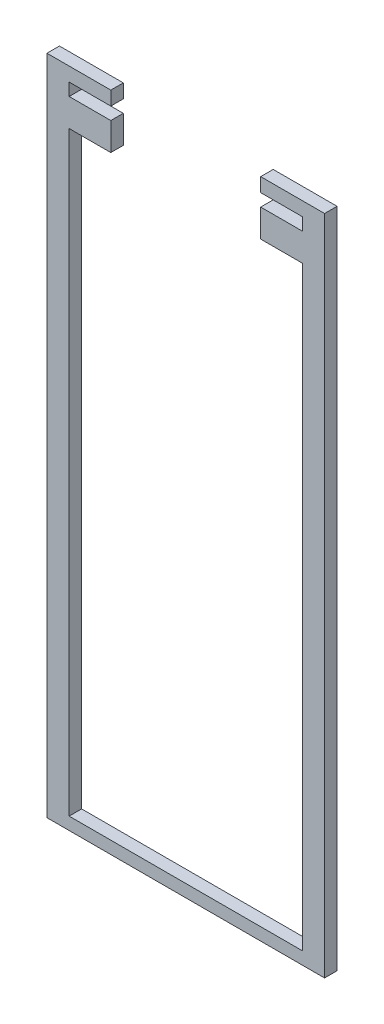
ISO-10303-21;
HEADER;
FILE_DESCRIPTION(('STEP AP214'),'2;1');
FILE_NAME('part.step','',(''),(''),'','','');
FILE_SCHEMA(('AUTOMOTIVE_DESIGN { 1 0 10303 214 1 1 1 1 }'));
ENDSEC;
DATA;
#1=APPLICATION_CONTEXT('core data for automotive mechanical design processes');
#2=APPLICATION_PROTOCOL_DEFINITION('international standard','automotive_design',2000,#1);
#3=PRODUCT_CONTEXT('',#1,'mechanical');
#4=PRODUCT('Part','Part','',(#3));
#5=PRODUCT_RELATED_PRODUCT_CATEGORY('part','',(#4));
#6=PRODUCT_DEFINITION_FORMATION('','',#4);
#7=PRODUCT_DEFINITION_CONTEXT('part definition',#1,'design');
#8=PRODUCT_DEFINITION('design','',#6,#7);
#9=PRODUCT_DEFINITION_SHAPE('','',#8);
#10=(LENGTH_UNIT() NAMED_UNIT(*) SI_UNIT(.MILLI.,.METRE.));
#11=(NAMED_UNIT(*) PLANE_ANGLE_UNIT() SI_UNIT($,.RADIAN.));
#12=(NAMED_UNIT(*) SI_UNIT($,.STERADIAN.) SOLID_ANGLE_UNIT());
#13=UNCERTAINTY_MEASURE_WITH_UNIT(LENGTH_MEASURE(1.E-05),#10,'distance_accuracy_value','');
#14=(GEOMETRIC_REPRESENTATION_CONTEXT(3) GLOBAL_UNCERTAINTY_ASSIGNED_CONTEXT((#13)) GLOBAL_UNIT_ASSIGNED_CONTEXT((#10,
#11,#12)) REPRESENTATION_CONTEXT('',''));
#15=CARTESIAN_POINT('',(0.,0.,0.));
#16=DIRECTION('',(0.,0.,1.));
#17=DIRECTION('',(1.,0.,0.));
#18=AXIS2_PLACEMENT_3D('',#15,#16,#17);
#19=CARTESIAN_POINT('',(40.120933274522,117.892622477071,4.5));
#20=DIRECTION('',(0.,-1.,0.));
#21=DIRECTION('',(0.,0.,-1.));
#22=AXIS2_PLACEMENT_3D('',#19,#20,#21);
#23=PLANE('',#22);
#24=DIRECTION('',(-1.,0.,0.));
#25=VECTOR('',#24,1.);
#26=CARTESIAN_POINT('',(40.120933274522,117.892622477071,0.));
#27=LINE('',#26,#25);
#28=CARTESIAN_POINT('',(40.120933274522,117.892622477071,0.));
#29=VERTEX_POINT('',#28);
#30=CARTESIAN_POINT('',(25.1209332745221,117.892622477071,0.));
#31=VERTEX_POINT('',#30);
#32=EDGE_CURVE('E207',#29,#31,#27,.T.);
#33=ORIENTED_EDGE('',*,*,#32,.T.);
#34=DIRECTION('',(0.,0.,-1.));
#35=VECTOR('',#34,1.);
#36=CARTESIAN_POINT('',(25.1209332745221,117.892622477071,4.5));
#37=LINE('',#36,#35);
#38=CARTESIAN_POINT('',(25.1209332745221,117.892622477071,4.5));
#39=VERTEX_POINT('',#38);
#40=EDGE_CURVE('E11',#39,#31,#37,.T.);
#41=ORIENTED_EDGE('',*,*,#40,.F.);
#42=DIRECTION('',(-1.,0.,0.));
#43=VECTOR('',#42,1.);
#44=CARTESIAN_POINT('',(40.120933274522,117.892622477071,4.5));
#45=LINE('',#44,#43);
#46=CARTESIAN_POINT('',(40.120933274522,117.892622477071,4.5));
#47=VERTEX_POINT('',#46);
#48=EDGE_CURVE('E245',#47,#39,#45,.T.);
#49=ORIENTED_EDGE('',*,*,#48,.F.);
#50=DIRECTION('',(0.,0.,-1.));
#51=VECTOR('',#50,1.);
#52=CARTESIAN_POINT('',(40.120933274522,117.892622477071,4.5));
#53=LINE('',#52,#51);
#54=EDGE_CURVE('E203',#47,#29,#53,.T.);
#55=ORIENTED_EDGE('',*,*,#54,.T.);
#56=EDGE_LOOP('',(#33,#41,#49,#55));
#57=FACE_BOUND('',#56,.T.);
#58=ADVANCED_FACE('F39',(#57),#23,.F.);
#59=CARTESIAN_POINT('',(25.1209332745221,117.892622477071,4.5));
#60=DIRECTION('',(1.,0.,0.));
#61=DIRECTION('',(0.,0.,-1.));
#62=AXIS2_PLACEMENT_3D('',#59,#60,#61);
#63=PLANE('',#62);
#64=DIRECTION('',(0.,-1.,0.));
#65=VECTOR('',#64,1.);
#66=CARTESIAN_POINT('',(25.1209332745221,117.892622477071,0.));
#67=LINE('',#66,#65);
#68=CARTESIAN_POINT('',(25.1209332745221,107.892622477071,0.));
#69=VERTEX_POINT('',#68);
#70=EDGE_CURVE('E210',#31,#69,#67,.T.);
#71=ORIENTED_EDGE('',*,*,#70,.T.);
#72=DIRECTION('',(0.,0.,-1.));
#73=VECTOR('',#72,1.);
#74=CARTESIAN_POINT('',(25.1209332745221,107.892622477071,4.5));
#75=LINE('',#74,#73);
#76=CARTESIAN_POINT('',(25.1209332745221,107.892622477071,4.5));
#77=VERTEX_POINT('',#76);
#78=EDGE_CURVE('E47',#77,#69,#75,.T.);
#79=ORIENTED_EDGE('',*,*,#78,.F.);
#80=DIRECTION('',(0.,-1.,0.));
#81=VECTOR('',#80,1.);
#82=CARTESIAN_POINT('',(25.1209332745221,117.892622477071,4.5));
#83=LINE('',#82,#81);
#84=EDGE_CURVE('E134',#39,#77,#83,.T.);
#85=ORIENTED_EDGE('',*,*,#84,.F.);
#86=ORIENTED_EDGE('',*,*,#40,.T.);
#87=EDGE_LOOP('',(#71,#79,#85,#86));
#88=FACE_BOUND('',#87,.T.);
#89=ADVANCED_FACE('F363',(#88),#63,.F.);
#90=CARTESIAN_POINT('',(25.1209332745221,107.892622477071,4.5));
#91=DIRECTION('',(0.,1.,0.));
#92=DIRECTION('',(0.,0.,1.));
#93=AXIS2_PLACEMENT_3D('',#90,#91,#92);
#94=PLANE('',#93);
#95=DIRECTION('',(1.,0.,0.));
#96=VECTOR('',#95,1.);
#97=CARTESIAN_POINT('',(25.1209332745221,107.892622477071,0.));
#98=LINE('',#97,#96);
#99=CARTESIAN_POINT('',(40.120933274522,107.892622477071,0.));
#100=VERTEX_POINT('',#99);
#101=EDGE_CURVE('E212',#69,#100,#98,.T.);
#102=ORIENTED_EDGE('',*,*,#101,.T.);
#103=DIRECTION('',(0.,0.,-1.));
#104=VECTOR('',#103,1.);
#105=CARTESIAN_POINT('',(40.120933274522,107.892622477071,4.5));
#106=LINE('',#105,#104);
#107=CARTESIAN_POINT('',(40.120933274522,107.892622477071,4.5));
#108=VERTEX_POINT('',#107);
#109=EDGE_CURVE('E288',#108,#100,#106,.T.);
#110=ORIENTED_EDGE('',*,*,#109,.F.);
#111=DIRECTION('',(1.,0.,0.));
#112=VECTOR('',#111,1.);
#113=CARTESIAN_POINT('',(25.1209332745221,107.892622477071,4.5));
#114=LINE('',#113,#112);
#115=EDGE_CURVE('E296',#77,#108,#114,.T.);
#116=ORIENTED_EDGE('',*,*,#115,.F.);
#117=ORIENTED_EDGE('',*,*,#78,.T.);
#118=EDGE_LOOP('',(#102,#110,#116,#117));
#119=FACE_BOUND('',#118,.T.);
#120=ADVANCED_FACE('F294',(#119),#94,.F.);
#121=CARTESIAN_POINT('',(40.120933274522,107.892622477071,4.5));
#122=DIRECTION('',(1.,0.,0.));
#123=DIRECTION('',(0.,0.,-1.));
#124=AXIS2_PLACEMENT_3D('',#121,#122,#123);
#125=PLANE('',#124);
#126=DIRECTION('',(0.,-1.,0.));
#127=VECTOR('',#126,1.);
#128=CARTESIAN_POINT('',(40.120933274522,107.892622477071,0.));
#129=LINE('',#128,#127);
#130=CARTESIAN_POINT('',(40.120933274522,-106.607377522929,0.));
#131=VERTEX_POINT('',#130);
#132=EDGE_CURVE('E214',#100,#131,#129,.T.);
#133=ORIENTED_EDGE('',*,*,#132,.T.);
#134=DIRECTION('',(0.,0.,-1.));
#135=VECTOR('',#134,1.);
#136=CARTESIAN_POINT('',(40.120933274522,-106.607377522929,4.5));
#137=LINE('',#136,#135);
#138=CARTESIAN_POINT('',(40.120933274522,-106.607377522929,4.5));
#139=VERTEX_POINT('',#138);
#140=EDGE_CURVE('E285',#139,#131,#137,.T.);
#141=ORIENTED_EDGE('',*,*,#140,.F.);
#142=DIRECTION('',(0.,-1.,0.));
#143=VECTOR('',#142,1.);
#144=CARTESIAN_POINT('',(40.120933274522,107.892622477071,4.5));
#145=LINE('',#144,#143);
#146=EDGE_CURVE('E314',#108,#139,#145,.T.);
#147=ORIENTED_EDGE('',*,*,#146,.F.);
#148=ORIENTED_EDGE('',*,*,#109,.T.);
#149=EDGE_LOOP('',(#133,#141,#147,#148));
#150=FACE_BOUND('',#149,.T.);
#151=ADVANCED_FACE('F305',(#150),#125,.F.);
#152=CARTESIAN_POINT('',(40.120933274522,-106.607377522929,4.5));
#153=DIRECTION('',(0.,-1.,0.));
#154=DIRECTION('',(0.,0.,-1.));
#155=AXIS2_PLACEMENT_3D('',#152,#153,#154);
#156=PLANE('',#155);
#157=DIRECTION('',(-1.,0.,0.));
#158=VECTOR('',#157,1.);
#159=CARTESIAN_POINT('',(40.120933274522,-106.607377522929,0.));
#160=LINE('',#159,#158);
#161=CARTESIAN_POINT('',(-43.8790667254779,-106.607377522929,0.));
#162=VERTEX_POINT('',#161);
#163=EDGE_CURVE('E216',#131,#162,#160,.T.);
#164=ORIENTED_EDGE('',*,*,#163,.T.);
#165=DIRECTION('',(0.,0.,-1.));
#166=VECTOR('',#165,1.);
#167=CARTESIAN_POINT('',(-43.8790667254779,-106.607377522929,4.5));
#168=LINE('',#167,#166);
#169=CARTESIAN_POINT('',(-43.8790667254779,-106.607377522929,4.5));
#170=VERTEX_POINT('',#169);
#171=EDGE_CURVE('E282',#170,#162,#168,.T.);
#172=ORIENTED_EDGE('',*,*,#171,.F.);
#173=DIRECTION('',(-1.,0.,0.));
#174=VECTOR('',#173,1.);
#175=CARTESIAN_POINT('',(40.120933274522,-106.607377522929,4.5));
#176=LINE('',#175,#174);
#177=EDGE_CURVE('E311',#139,#170,#176,.T.);
#178=ORIENTED_EDGE('',*,*,#177,.F.);
#179=ORIENTED_EDGE('',*,*,#140,.T.);
#180=EDGE_LOOP('',(#164,#172,#178,#179));
#181=FACE_BOUND('',#180,.T.);
#182=ADVANCED_FACE('F309',(#181),#156,.F.);
#183=CARTESIAN_POINT('',(-43.8790667254779,-106.607377522929,4.5));
#184=DIRECTION('',(-1.,0.,0.));
#185=DIRECTION('',(0.,0.,1.));
#186=AXIS2_PLACEMENT_3D('',#183,#184,#185);
#187=PLANE('',#186);
#188=DIRECTION('',(0.,1.,0.));
#189=VECTOR('',#188,1.);
#190=CARTESIAN_POINT('',(-43.8790667254779,-106.607377522929,0.));
#191=LINE('',#190,#189);
#192=CARTESIAN_POINT('',(-43.8790667254779,107.892622477071,0.));
#193=VERTEX_POINT('',#192);
#194=EDGE_CURVE('E218',#162,#193,#191,.T.);
#195=ORIENTED_EDGE('',*,*,#194,.T.);
#196=DIRECTION('',(0.,0.,-1.));
#197=VECTOR('',#196,1.);
#198=CARTESIAN_POINT('',(-43.8790667254779,107.892622477071,4.5));
#199=LINE('',#198,#197);
#200=CARTESIAN_POINT('',(-43.8790667254779,107.892622477071,4.5));
#201=VERTEX_POINT('',#200);
#202=EDGE_CURVE('E279',#201,#193,#199,.T.);
#203=ORIENTED_EDGE('',*,*,#202,.F.);
#204=DIRECTION('',(0.,1.,0.));
#205=VECTOR('',#204,1.);
#206=CARTESIAN_POINT('',(-43.8790667254779,-106.607377522929,4.5));
#207=LINE('',#206,#205);
#208=EDGE_CURVE('E313',#170,#201,#207,.T.);
#209=ORIENTED_EDGE('',*,*,#208,.F.);
#210=ORIENTED_EDGE('',*,*,#171,.T.);
#211=EDGE_LOOP('',(#195,#203,#209,#210));
#212=FACE_BOUND('',#211,.T.);
#213=ADVANCED_FACE('F376',(#212),#187,.F.);
#214=CARTESIAN_POINT('',(-28.8790667254779,107.892622477071,4.5));
#215=DIRECTION('',(0.,1.,0.));
#216=DIRECTION('',(0.,0.,1.));
#217=AXIS2_PLACEMENT_3D('',#214,#215,#216);
#218=PLANE('',#217);
#219=DIRECTION('',(1.,0.,0.));
#220=VECTOR('',#219,1.);
#221=CARTESIAN_POINT('',(-28.8790667254779,107.892622477071,0.));
#222=LINE('',#221,#220);
#223=CARTESIAN_POINT('',(-28.8790667254779,107.892622477071,0.));
#224=VERTEX_POINT('',#223);
#225=EDGE_CURVE('E220',#193,#224,#222,.T.);
#226=ORIENTED_EDGE('',*,*,#225,.T.);
#227=DIRECTION('',(0.,0.,-1.));
#228=VECTOR('',#227,1.);
#229=CARTESIAN_POINT('',(-28.8790667254779,107.892622477071,4.5));
#230=LINE('',#229,#228);
#231=CARTESIAN_POINT('',(-28.8790667254779,107.892622477071,4.5));
#232=VERTEX_POINT('',#231);
#233=EDGE_CURVE('E276',#232,#224,#230,.T.);
#234=ORIENTED_EDGE('',*,*,#233,.F.);
#235=DIRECTION('',(1.,0.,0.));
#236=VECTOR('',#235,1.);
#237=CARTESIAN_POINT('',(-28.8790667254779,107.892622477071,4.5));
#238=LINE('',#237,#236);
#239=EDGE_CURVE('E316',#201,#232,#238,.T.);
#240=ORIENTED_EDGE('',*,*,#239,.F.);
#241=ORIENTED_EDGE('',*,*,#202,.T.);
#242=EDGE_LOOP('',(#226,#234,#240,#241));
#243=FACE_BOUND('',#242,.T.);
#244=ADVANCED_FACE('F379',(#243),#218,.F.);
#245=CARTESIAN_POINT('',(-28.8790667254779,117.892622477071,4.5));
#246=DIRECTION('',(-1.,0.,0.));
#247=DIRECTION('',(0.,0.,1.));
#248=AXIS2_PLACEMENT_3D('',#245,#246,#247);
#249=PLANE('',#248);
#250=DIRECTION('',(0.,1.,0.));
#251=VECTOR('',#250,1.);
#252=CARTESIAN_POINT('',(-28.8790667254779,117.892622477071,0.));
#253=LINE('',#252,#251);
#254=CARTESIAN_POINT('',(-28.8790667254779,117.892622477071,0.));
#255=VERTEX_POINT('',#254);
#256=EDGE_CURVE('E222',#224,#255,#253,.T.);
#257=ORIENTED_EDGE('',*,*,#256,.T.);
#258=DIRECTION('',(0.,0.,-1.));
#259=VECTOR('',#258,1.);
#260=CARTESIAN_POINT('',(-28.8790667254779,117.892622477071,4.5));
#261=LINE('',#260,#259);
#262=CARTESIAN_POINT('',(-28.8790667254779,117.892622477071,4.5));
#263=VERTEX_POINT('',#262);
#264=EDGE_CURVE('E273',#263,#255,#261,.T.);
#265=ORIENTED_EDGE('',*,*,#264,.F.);
#266=DIRECTION('',(0.,1.,0.));
#267=VECTOR('',#266,1.);
#268=CARTESIAN_POINT('',(-28.8790667254779,117.892622477071,4.5));
#269=LINE('',#268,#267);
#270=EDGE_CURVE('E322',#232,#263,#269,.T.);
#271=ORIENTED_EDGE('',*,*,#270,.F.);
#272=ORIENTED_EDGE('',*,*,#233,.T.);
#273=EDGE_LOOP('',(#257,#265,#271,#272));
#274=FACE_BOUND('',#273,.T.);
#275=ADVANCED_FACE('F383',(#274),#249,.F.);
#276=CARTESIAN_POINT('',(-43.8790667254779,117.892622477071,4.5));
#277=DIRECTION('',(0.,-1.,0.));
#278=DIRECTION('',(0.,0.,-1.));
#279=AXIS2_PLACEMENT_3D('',#276,#277,#278);
#280=PLANE('',#279);
#281=DIRECTION('',(-1.,0.,0.));
#282=VECTOR('',#281,1.);
#283=CARTESIAN_POINT('',(-43.8790667254779,117.892622477071,0.));
#284=LINE('',#283,#282);
#285=CARTESIAN_POINT('',(-43.8790667254779,117.892622477071,0.));
#286=VERTEX_POINT('',#285);
#287=EDGE_CURVE('E224',#255,#286,#284,.T.);
#288=ORIENTED_EDGE('',*,*,#287,.T.);
#289=DIRECTION('',(0.,0.,-1.));
#290=VECTOR('',#289,1.);
#291=CARTESIAN_POINT('',(-43.8790667254779,117.892622477071,4.5));
#292=LINE('',#291,#290);
#293=CARTESIAN_POINT('',(-43.8790667254779,117.892622477071,4.5));
#294=VERTEX_POINT('',#293);
#295=EDGE_CURVE('E270',#294,#286,#292,.T.);
#296=ORIENTED_EDGE('',*,*,#295,.F.);
#297=DIRECTION('',(-1.,0.,0.));
#298=VECTOR('',#297,1.);
#299=CARTESIAN_POINT('',(-43.8790667254779,117.892622477071,4.5));
#300=LINE('',#299,#298);
#301=EDGE_CURVE('E324',#263,#294,#300,.T.);
#302=ORIENTED_EDGE('',*,*,#301,.F.);
#303=ORIENTED_EDGE('',*,*,#264,.T.);
#304=EDGE_LOOP('',(#288,#296,#302,#303));
#305=FACE_BOUND('',#304,.T.);
#306=ADVANCED_FACE('F387',(#305),#280,.F.);
#307=CARTESIAN_POINT('',(-43.8790667254779,117.892622477071,4.5));
#308=DIRECTION('',(-1.,0.,0.));
#309=DIRECTION('',(0.,0.,1.));
#310=AXIS2_PLACEMENT_3D('',#307,#308,#309);
#311=PLANE('',#310);
#312=DIRECTION('',(0.,1.,0.));
#313=VECTOR('',#312,1.);
#314=CARTESIAN_POINT('',(-43.8790667254779,117.892622477071,0.));
#315=LINE('',#314,#313);
#316=CARTESIAN_POINT('',(-43.8790667254779,122.392622477071,0.));
#317=VERTEX_POINT('',#316);
#318=EDGE_CURVE('E226',#286,#317,#315,.T.);
#319=ORIENTED_EDGE('',*,*,#318,.T.);
#320=DIRECTION('',(0.,0.,-1.));
#321=VECTOR('',#320,1.);
#322=CARTESIAN_POINT('',(-43.8790667254779,122.392622477071,4.5));
#323=LINE('',#322,#321);
#324=CARTESIAN_POINT('',(-43.8790667254779,122.392622477071,4.5));
#325=VERTEX_POINT('',#324);
#326=EDGE_CURVE('E267',#325,#317,#323,.T.);
#327=ORIENTED_EDGE('',*,*,#326,.F.);
#328=DIRECTION('',(0.,1.,0.));
#329=VECTOR('',#328,1.);
#330=CARTESIAN_POINT('',(-43.8790667254779,117.892622477071,4.5));
#331=LINE('',#330,#329);
#332=EDGE_CURVE('E326',#294,#325,#331,.T.);
#333=ORIENTED_EDGE('',*,*,#332,.F.);
#334=ORIENTED_EDGE('',*,*,#295,.T.);
#335=EDGE_LOOP('',(#319,#327,#333,#334));
#336=FACE_BOUND('',#335,.T.);
#337=ADVANCED_FACE('F391',(#336),#311,.F.);
#338=CARTESIAN_POINT('',(-43.8790667254779,122.392622477071,4.5));
#339=DIRECTION('',(0.,1.,0.));
#340=DIRECTION('',(0.,0.,1.));
#341=AXIS2_PLACEMENT_3D('',#338,#339,#340);
#342=PLANE('',#341);
#343=DIRECTION('',(1.,0.,0.));
#344=VECTOR('',#343,1.);
#345=CARTESIAN_POINT('',(-43.8790667254779,122.392622477071,0.));
#346=LINE('',#345,#344);
#347=CARTESIAN_POINT('',(-28.8790667254779,122.392622477071,0.));
#348=VERTEX_POINT('',#347);
#349=EDGE_CURVE('E228',#317,#348,#346,.T.);
#350=ORIENTED_EDGE('',*,*,#349,.T.);
#351=DIRECTION('',(0.,0.,-1.));
#352=VECTOR('',#351,1.);
#353=CARTESIAN_POINT('',(-28.8790667254779,122.392622477071,4.5));
#354=LINE('',#353,#352);
#355=CARTESIAN_POINT('',(-28.8790667254779,122.392622477071,4.5));
#356=VERTEX_POINT('',#355);
#357=EDGE_CURVE('E264',#356,#348,#354,.T.);
#358=ORIENTED_EDGE('',*,*,#357,.F.);
#359=DIRECTION('',(1.,0.,0.));
#360=VECTOR('',#359,1.);
#361=CARTESIAN_POINT('',(-43.8790667254779,122.392622477071,4.5));
#362=LINE('',#361,#360);
#363=EDGE_CURVE('E328',#325,#356,#362,.T.);
#364=ORIENTED_EDGE('',*,*,#363,.F.);
#365=ORIENTED_EDGE('',*,*,#326,.T.);
#366=EDGE_LOOP('',(#350,#358,#364,#365));
#367=FACE_BOUND('',#366,.T.);
#368=ADVANCED_FACE('F395',(#367),#342,.F.);
#369=CARTESIAN_POINT('',(-28.8790667254779,122.392622477071,4.5));
#370=DIRECTION('',(-1.,0.,0.));
#371=DIRECTION('',(0.,0.,1.));
#372=AXIS2_PLACEMENT_3D('',#369,#370,#371);
#373=PLANE('',#372);
#374=DIRECTION('',(0.,1.,0.));
#375=VECTOR('',#374,1.);
#376=CARTESIAN_POINT('',(-28.8790667254779,122.392622477071,0.));
#377=LINE('',#376,#375);
#378=CARTESIAN_POINT('',(-28.8790667254779,127.392622477071,0.));
#379=VERTEX_POINT('',#378);
#380=EDGE_CURVE('E230',#348,#379,#377,.T.);
#381=ORIENTED_EDGE('',*,*,#380,.T.);
#382=DIRECTION('',(0.,0.,-1.));
#383=VECTOR('',#382,1.);
#384=CARTESIAN_POINT('',(-28.8790667254779,127.392622477071,4.5));
#385=LINE('',#384,#383);
#386=CARTESIAN_POINT('',(-28.8790667254779,127.392622477071,4.5));
#387=VERTEX_POINT('',#386);
#388=EDGE_CURVE('E261',#387,#379,#385,.T.);
#389=ORIENTED_EDGE('',*,*,#388,.F.);
#390=DIRECTION('',(0.,1.,0.));
#391=VECTOR('',#390,1.);
#392=CARTESIAN_POINT('',(-28.8790667254779,122.392622477071,4.5));
#393=LINE('',#392,#391);
#394=EDGE_CURVE('E330',#356,#387,#393,.T.);
#395=ORIENTED_EDGE('',*,*,#394,.F.);
#396=ORIENTED_EDGE('',*,*,#357,.T.);
#397=EDGE_LOOP('',(#381,#389,#395,#396));
#398=FACE_BOUND('',#397,.T.);
#399=ADVANCED_FACE('F399',(#398),#373,.F.);
#400=CARTESIAN_POINT('',(-28.8790667254779,127.392622477071,4.5));
#401=DIRECTION('',(0.,-1.,0.));
#402=DIRECTION('',(0.,0.,-1.));
#403=AXIS2_PLACEMENT_3D('',#400,#401,#402);
#404=PLANE('',#403);
#405=DIRECTION('',(-1.,0.,0.));
#406=VECTOR('',#405,1.);
#407=CARTESIAN_POINT('',(-28.8790667254779,127.392622477071,0.));
#408=LINE('',#407,#406);
#409=CARTESIAN_POINT('',(-51.879066725478,127.392622477071,0.));
#410=VERTEX_POINT('',#409);
#411=EDGE_CURVE('E232',#379,#410,#408,.T.);
#412=ORIENTED_EDGE('',*,*,#411,.T.);
#413=DIRECTION('',(0.,0.,-1.));
#414=VECTOR('',#413,1.);
#415=CARTESIAN_POINT('',(-51.879066725478,127.392622477071,4.5));
#416=LINE('',#415,#414);
#417=CARTESIAN_POINT('',(-51.879066725478,127.392622477071,4.5));
#418=VERTEX_POINT('',#417);
#419=EDGE_CURVE('E258',#418,#410,#416,.T.);
#420=ORIENTED_EDGE('',*,*,#419,.F.);
#421=DIRECTION('',(-1.,0.,0.));
#422=VECTOR('',#421,1.);
#423=CARTESIAN_POINT('',(-28.8790667254779,127.392622477071,4.5));
#424=LINE('',#423,#422);
#425=EDGE_CURVE('E332',#387,#418,#424,.T.);
#426=ORIENTED_EDGE('',*,*,#425,.F.);
#427=ORIENTED_EDGE('',*,*,#388,.T.);
#428=EDGE_LOOP('',(#412,#420,#426,#427));
#429=FACE_BOUND('',#428,.T.);
#430=ADVANCED_FACE('F403',(#429),#404,.F.);
#431=CARTESIAN_POINT('',(-51.879066725478,127.392622477071,4.5));
#432=DIRECTION('',(1.,0.,0.));
#433=DIRECTION('',(0.,0.,-1.));
#434=AXIS2_PLACEMENT_3D('',#431,#432,#433);
#435=PLANE('',#434);
#436=DIRECTION('',(0.,-1.,0.));
#437=VECTOR('',#436,1.);
#438=CARTESIAN_POINT('',(-51.879066725478,127.392622477071,0.));
#439=LINE('',#438,#437);
#440=CARTESIAN_POINT('',(-51.879066725478,-111.107377522929,0.));
#441=VERTEX_POINT('',#440);
#442=EDGE_CURVE('E234',#410,#441,#439,.T.);
#443=ORIENTED_EDGE('',*,*,#442,.T.);
#444=DIRECTION('',(0.,0.,-1.));
#445=VECTOR('',#444,1.);
#446=CARTESIAN_POINT('',(-51.879066725478,-111.107377522929,4.5));
#447=LINE('',#446,#445);
#448=CARTESIAN_POINT('',(-51.879066725478,-111.107377522929,4.5));
#449=VERTEX_POINT('',#448);
#450=EDGE_CURVE('E255',#449,#441,#447,.T.);
#451=ORIENTED_EDGE('',*,*,#450,.F.);
#452=DIRECTION('',(0.,-1.,0.));
#453=VECTOR('',#452,1.);
#454=CARTESIAN_POINT('',(-51.879066725478,127.392622477071,4.5));
#455=LINE('',#454,#453);
#456=EDGE_CURVE('E334',#418,#449,#455,.T.);
#457=ORIENTED_EDGE('',*,*,#456,.F.);
#458=ORIENTED_EDGE('',*,*,#419,.T.);
#459=EDGE_LOOP('',(#443,#451,#457,#458));
#460=FACE_BOUND('',#459,.T.);
#461=ADVANCED_FACE('F407',(#460),#435,.F.);
#462=CARTESIAN_POINT('',(-51.879066725478,-111.107377522929,4.5));
#463=DIRECTION('',(0.,1.,0.));
#464=DIRECTION('',(0.,0.,1.));
#465=AXIS2_PLACEMENT_3D('',#462,#463,#464);
#466=PLANE('',#465);
#467=DIRECTION('',(1.,0.,0.));
#468=VECTOR('',#467,1.);
#469=CARTESIAN_POINT('',(-51.879066725478,-111.107377522929,0.));
#470=LINE('',#469,#468);
#471=CARTESIAN_POINT('',(48.120933274522,-111.107377522929,0.));
#472=VERTEX_POINT('',#471);
#473=EDGE_CURVE('E236',#441,#472,#470,.T.);
#474=ORIENTED_EDGE('',*,*,#473,.T.);
#475=DIRECTION('',(0.,0.,-1.));
#476=VECTOR('',#475,1.);
#477=CARTESIAN_POINT('',(48.120933274522,-111.107377522929,4.5));
#478=LINE('',#477,#476);
#479=CARTESIAN_POINT('',(48.120933274522,-111.107377522929,4.5));
#480=VERTEX_POINT('',#479);
#481=EDGE_CURVE('E252',#480,#472,#478,.T.);
#482=ORIENTED_EDGE('',*,*,#481,.F.);
#483=DIRECTION('',(1.,0.,0.));
#484=VECTOR('',#483,1.);
#485=CARTESIAN_POINT('',(-51.879066725478,-111.107377522929,4.5));
#486=LINE('',#485,#484);
#487=EDGE_CURVE('E336',#449,#480,#486,.T.);
#488=ORIENTED_EDGE('',*,*,#487,.F.);
#489=ORIENTED_EDGE('',*,*,#450,.T.);
#490=EDGE_LOOP('',(#474,#482,#488,#489));
#491=FACE_BOUND('',#490,.T.);
#492=ADVANCED_FACE('F411',(#491),#466,.F.);
#493=CARTESIAN_POINT('',(48.120933274522,127.392622477071,4.5));
#494=DIRECTION('',(-1.,0.,0.));
#495=DIRECTION('',(0.,0.,1.));
#496=AXIS2_PLACEMENT_3D('',#493,#494,#495);
#497=PLANE('',#496);
#498=DIRECTION('',(0.,1.,0.));
#499=VECTOR('',#498,1.);
#500=CARTESIAN_POINT('',(48.120933274522,127.392622477071,0.));
#501=LINE('',#500,#499);
#502=CARTESIAN_POINT('',(48.120933274522,127.392622477071,0.));
#503=VERTEX_POINT('',#502);
#504=EDGE_CURVE('E238',#472,#503,#501,.T.);
#505=ORIENTED_EDGE('',*,*,#504,.T.);
#506=DIRECTION('',(0.,0.,-1.));
#507=VECTOR('',#506,1.);
#508=CARTESIAN_POINT('',(48.120933274522,127.392622477071,4.5));
#509=LINE('',#508,#507);
#510=CARTESIAN_POINT('',(48.120933274522,127.392622477071,4.5));
#511=VERTEX_POINT('',#510);
#512=EDGE_CURVE('E249',#511,#503,#509,.T.);
#513=ORIENTED_EDGE('',*,*,#512,.F.);
#514=DIRECTION('',(0.,1.,0.));
#515=VECTOR('',#514,1.);
#516=CARTESIAN_POINT('',(48.120933274522,127.392622477071,4.5));
#517=LINE('',#516,#515);
#518=EDGE_CURVE('E338',#480,#511,#517,.T.);
#519=ORIENTED_EDGE('',*,*,#518,.F.);
#520=ORIENTED_EDGE('',*,*,#481,.T.);
#521=EDGE_LOOP('',(#505,#513,#519,#520));
#522=FACE_BOUND('',#521,.T.);
#523=ADVANCED_FACE('F344',(#522),#497,.F.);
#524=CARTESIAN_POINT('',(25.1209332745221,127.392622477071,4.5));
#525=DIRECTION('',(0.,-1.,0.));
#526=DIRECTION('',(0.,0.,-1.));
#527=AXIS2_PLACEMENT_3D('',#524,#525,#526);
#528=PLANE('',#527);
#529=DIRECTION('',(-1.,0.,0.));
#530=VECTOR('',#529,1.);
#531=CARTESIAN_POINT('',(25.1209332745221,127.392622477071,0.));
#532=LINE('',#531,#530);
#533=CARTESIAN_POINT('',(25.1209332745221,127.392622477071,0.));
#534=VERTEX_POINT('',#533);
#535=EDGE_CURVE('E240',#503,#534,#532,.T.);
#536=ORIENTED_EDGE('',*,*,#535,.T.);
#537=DIRECTION('',(0.,0.,-1.));
#538=VECTOR('',#537,1.);
#539=CARTESIAN_POINT('',(25.1209332745221,127.392622477071,4.5));
#540=LINE('',#539,#538);
#541=CARTESIAN_POINT('',(25.1209332745221,127.392622477071,4.5));
#542=VERTEX_POINT('',#541);
#543=EDGE_CURVE('E198',#542,#534,#540,.T.);
#544=ORIENTED_EDGE('',*,*,#543,.F.);
#545=DIRECTION('',(-1.,0.,0.));
#546=VECTOR('',#545,1.);
#547=CARTESIAN_POINT('',(25.1209332745221,127.392622477071,4.5));
#548=LINE('',#547,#546);
#549=EDGE_CURVE('E189',#511,#542,#548,.T.);
#550=ORIENTED_EDGE('',*,*,#549,.F.);
#551=ORIENTED_EDGE('',*,*,#512,.T.);
#552=EDGE_LOOP('',(#536,#544,#550,#551));
#553=FACE_BOUND('',#552,.T.);
#554=ADVANCED_FACE('F348',(#553),#528,.F.);
#555=CARTESIAN_POINT('',(25.1209332745221,122.392622477071,4.5));
#556=DIRECTION('',(1.,0.,0.));
#557=DIRECTION('',(0.,0.,-1.));
#558=AXIS2_PLACEMENT_3D('',#555,#556,#557);
#559=PLANE('',#558);
#560=DIRECTION('',(0.,-1.,0.));
#561=VECTOR('',#560,1.);
#562=CARTESIAN_POINT('',(25.1209332745221,122.392622477071,0.));
#563=LINE('',#562,#561);
#564=CARTESIAN_POINT('',(25.1209332745221,122.392622477071,0.));
#565=VERTEX_POINT('',#564);
#566=EDGE_CURVE('E197',#534,#565,#563,.T.);
#567=ORIENTED_EDGE('',*,*,#566,.T.);
#568=DIRECTION('',(0.,0.,-1.));
#569=VECTOR('',#568,1.);
#570=CARTESIAN_POINT('',(25.1209332745221,122.392622477071,4.5));
#571=LINE('',#570,#569);
#572=CARTESIAN_POINT('',(25.1209332745221,122.392622477071,4.5));
#573=VERTEX_POINT('',#572);
#574=EDGE_CURVE('E194',#573,#565,#571,.T.);
#575=ORIENTED_EDGE('',*,*,#574,.F.);
#576=DIRECTION('',(0.,-1.,0.));
#577=VECTOR('',#576,1.);
#578=CARTESIAN_POINT('',(25.1209332745221,122.392622477071,4.5));
#579=LINE('',#578,#577);
#580=EDGE_CURVE('E183',#542,#573,#579,.T.);
#581=ORIENTED_EDGE('',*,*,#580,.F.);
#582=ORIENTED_EDGE('',*,*,#543,.T.);
#583=EDGE_LOOP('',(#567,#575,#581,#582));
#584=FACE_BOUND('',#583,.T.);
#585=ADVANCED_FACE('F195',(#584),#559,.F.);
#586=CARTESIAN_POINT('',(40.120933274522,122.392622477071,4.5));
#587=DIRECTION('',(0.,1.,0.));
#588=DIRECTION('',(0.,0.,1.));
#589=AXIS2_PLACEMENT_3D('',#586,#587,#588);
#590=PLANE('',#589);
#591=DIRECTION('',(1.,0.,0.));
#592=VECTOR('',#591,1.);
#593=CARTESIAN_POINT('',(40.120933274522,122.392622477071,0.));
#594=LINE('',#593,#592);
#595=CARTESIAN_POINT('',(40.120933274522,122.392622477071,0.));
#596=VERTEX_POINT('',#595);
#597=EDGE_CURVE('E120',#565,#596,#594,.T.);
#598=ORIENTED_EDGE('',*,*,#597,.T.);
#599=DIRECTION('',(0.,0.,-1.));
#600=VECTOR('',#599,1.);
#601=CARTESIAN_POINT('',(40.120933274522,122.392622477071,4.5));
#602=LINE('',#601,#600);
#603=CARTESIAN_POINT('',(40.120933274522,122.392622477071,4.5));
#604=VERTEX_POINT('',#603);
#605=EDGE_CURVE('E199',#604,#596,#602,.T.);
#606=ORIENTED_EDGE('',*,*,#605,.F.);
#607=DIRECTION('',(1.,0.,0.));
#608=VECTOR('',#607,1.);
#609=CARTESIAN_POINT('',(40.120933274522,122.392622477071,4.5));
#610=LINE('',#609,#608);
#611=EDGE_CURVE('E187',#573,#604,#610,.T.);
#612=ORIENTED_EDGE('',*,*,#611,.F.);
#613=ORIENTED_EDGE('',*,*,#574,.T.);
#614=EDGE_LOOP('',(#598,#606,#612,#613));
#615=FACE_BOUND('',#614,.T.);
#616=ADVANCED_FACE('F201',(#615),#590,.F.);
#617=CARTESIAN_POINT('',(40.120933274522,117.892622477071,4.5));
#618=DIRECTION('',(1.,0.,0.));
#619=DIRECTION('',(0.,0.,-1.));
#620=AXIS2_PLACEMENT_3D('',#617,#618,#619);
#621=PLANE('',#620);
#622=DIRECTION('',(0.,-1.,0.));
#623=VECTOR('',#622,1.);
#624=CARTESIAN_POINT('',(40.120933274522,117.892622477071,0.));
#625=LINE('',#624,#623);
#626=EDGE_CURVE('E126',#596,#29,#625,.T.);
#627=ORIENTED_EDGE('',*,*,#626,.T.);
#628=ORIENTED_EDGE('',*,*,#54,.F.);
#629=DIRECTION('',(0.,-1.,0.));
#630=VECTOR('',#629,1.);
#631=CARTESIAN_POINT('',(40.120933274522,117.892622477071,4.5));
#632=LINE('',#631,#630);
#633=EDGE_CURVE('E55',#604,#47,#632,.T.);
#634=ORIENTED_EDGE('',*,*,#633,.F.);
#635=ORIENTED_EDGE('',*,*,#605,.T.);
#636=EDGE_LOOP('',(#627,#628,#634,#635));
#637=FACE_BOUND('',#636,.T.);
#638=ADVANCED_FACE('F352',(#637),#621,.F.);
#639=CARTESIAN_POINT('',(0.,0.,4.5));
#640=DIRECTION('',(0.,0.,1.));
#641=DIRECTION('',(1.,0.,0.));
#642=AXIS2_PLACEMENT_3D('',#639,#640,#641);
#643=PLANE('',#642);
#644=ORIENTED_EDGE('',*,*,#48,.T.);
#645=ORIENTED_EDGE('',*,*,#84,.T.);
#646=ORIENTED_EDGE('',*,*,#115,.T.);
#647=ORIENTED_EDGE('',*,*,#146,.T.);
#648=ORIENTED_EDGE('',*,*,#177,.T.);
#649=ORIENTED_EDGE('',*,*,#208,.T.);
#650=ORIENTED_EDGE('',*,*,#239,.T.);
#651=ORIENTED_EDGE('',*,*,#270,.T.);
#652=ORIENTED_EDGE('',*,*,#301,.T.);
#653=ORIENTED_EDGE('',*,*,#332,.T.);
#654=ORIENTED_EDGE('',*,*,#363,.T.);
#655=ORIENTED_EDGE('',*,*,#394,.T.);
#656=ORIENTED_EDGE('',*,*,#425,.T.);
#657=ORIENTED_EDGE('',*,*,#456,.T.);
#658=ORIENTED_EDGE('',*,*,#487,.T.);
#659=ORIENTED_EDGE('',*,*,#518,.T.);
#660=ORIENTED_EDGE('',*,*,#549,.T.);
#661=ORIENTED_EDGE('',*,*,#580,.T.);
#662=ORIENTED_EDGE('',*,*,#611,.T.);
#663=ORIENTED_EDGE('',*,*,#633,.T.);
#664=EDGE_LOOP('',(#644,#645,#646,#647,#648,#649,#650,#651,#652,#653,#654,#655,#656,#657,#658,
#659,#660,#661,#662,#663));
#665=FACE_BOUND('',#664,.T.);
#666=ADVANCED_FACE('F185',(#665),#643,.T.);
#667=CARTESIAN_POINT('',(0.,0.,0.));
#668=DIRECTION('',(0.,0.,1.));
#669=DIRECTION('',(1.,0.,0.));
#670=AXIS2_PLACEMENT_3D('',#667,#668,#669);
#671=PLANE('',#670);
#672=ORIENTED_EDGE('',*,*,#32,.F.);
#673=ORIENTED_EDGE('',*,*,#626,.F.);
#674=ORIENTED_EDGE('',*,*,#597,.F.);
#675=ORIENTED_EDGE('',*,*,#566,.F.);
#676=ORIENTED_EDGE('',*,*,#535,.F.);
#677=ORIENTED_EDGE('',*,*,#504,.F.);
#678=ORIENTED_EDGE('',*,*,#473,.F.);
#679=ORIENTED_EDGE('',*,*,#442,.F.);
#680=ORIENTED_EDGE('',*,*,#411,.F.);
#681=ORIENTED_EDGE('',*,*,#380,.F.);
#682=ORIENTED_EDGE('',*,*,#349,.F.);
#683=ORIENTED_EDGE('',*,*,#318,.F.);
#684=ORIENTED_EDGE('',*,*,#287,.F.);
#685=ORIENTED_EDGE('',*,*,#256,.F.);
#686=ORIENTED_EDGE('',*,*,#225,.F.);
#687=ORIENTED_EDGE('',*,*,#194,.F.);
#688=ORIENTED_EDGE('',*,*,#163,.F.);
#689=ORIENTED_EDGE('',*,*,#132,.F.);
#690=ORIENTED_EDGE('',*,*,#101,.F.);
#691=ORIENTED_EDGE('',*,*,#70,.F.);
#692=EDGE_LOOP('',(#672,#673,#674,#675,#676,#677,#678,#679,#680,#681,#682,#683,#684,#685,#686,
#687,#688,#689,#690,#691));
#693=FACE_BOUND('',#692,.T.);
#694=ADVANCED_FACE('F300',(#693),#671,.F.);
#695=CLOSED_SHELL('',(#58,#89,#120,#151,#182,#213,#244,#275,#306,#337,#368,#399,#430,#461,#492,
#523,#554,#585,#616,#638,#666,#694));
#696=MANIFOLD_SOLID_BREP('B2',#695);
#697=ADVANCED_BREP_SHAPE_REPRESENTATION('',(#18,#696),#14);
#698=SHAPE_DEFINITION_REPRESENTATION(#9,#697);
ENDSEC;
END-ISO-10303-21;
